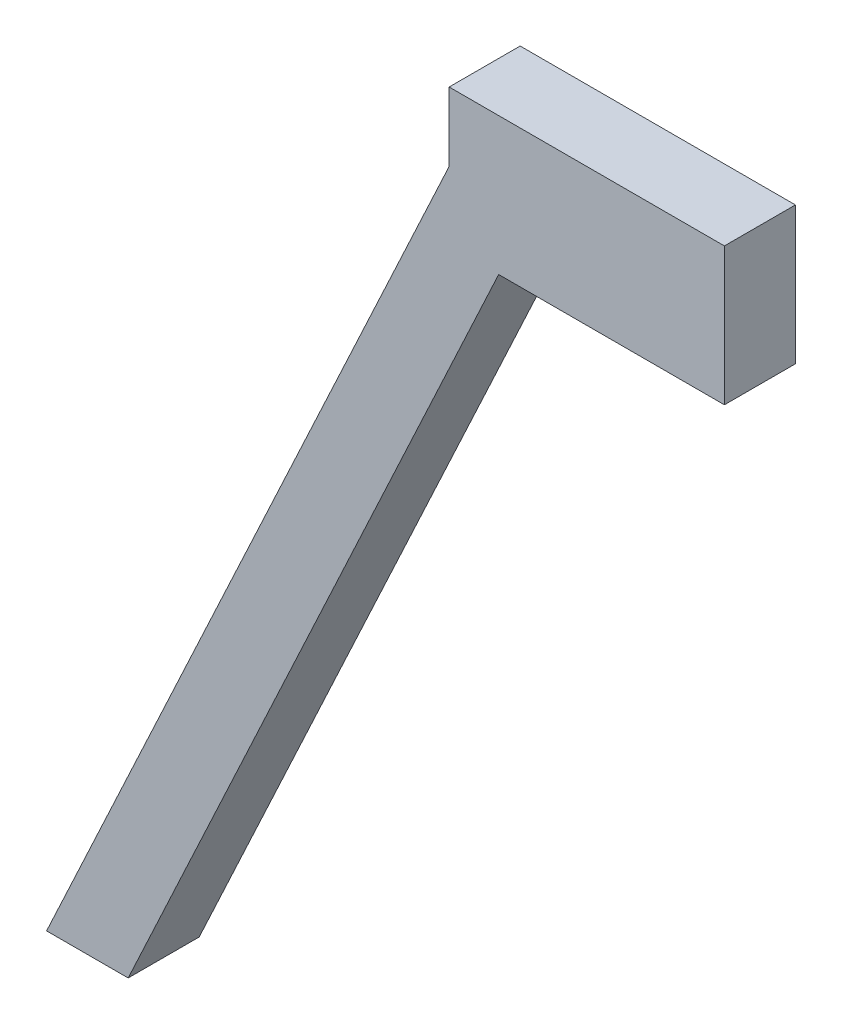
ISO-10303-21;
HEADER;
FILE_DESCRIPTION(('STEP AP214'),'2;1');
FILE_NAME('part.step','',(''),(''),'','','');
FILE_SCHEMA(('AUTOMOTIVE_DESIGN { 1 0 10303 214 1 1 1 1 }'));
ENDSEC;
DATA;
#1=APPLICATION_CONTEXT('core data for automotive mechanical design processes');
#2=APPLICATION_PROTOCOL_DEFINITION('international standard','automotive_design',2000,#1);
#3=PRODUCT_CONTEXT('',#1,'mechanical');
#4=PRODUCT('Part','Part','',(#3));
#5=PRODUCT_RELATED_PRODUCT_CATEGORY('part','',(#4));
#6=PRODUCT_DEFINITION_FORMATION('','',#4);
#7=PRODUCT_DEFINITION_CONTEXT('part definition',#1,'design');
#8=PRODUCT_DEFINITION('design','',#6,#7);
#9=PRODUCT_DEFINITION_SHAPE('','',#8);
#10=(LENGTH_UNIT() NAMED_UNIT(*) SI_UNIT(.MILLI.,.METRE.));
#11=(NAMED_UNIT(*) PLANE_ANGLE_UNIT() SI_UNIT($,.RADIAN.));
#12=(NAMED_UNIT(*) SI_UNIT($,.STERADIAN.) SOLID_ANGLE_UNIT());
#13=UNCERTAINTY_MEASURE_WITH_UNIT(LENGTH_MEASURE(1.E-05),#10,'distance_accuracy_value','');
#14=(GEOMETRIC_REPRESENTATION_CONTEXT(3) GLOBAL_UNCERTAINTY_ASSIGNED_CONTEXT((#13)) GLOBAL_UNIT_ASSIGNED_CONTEXT((#10,
#11,#12)) REPRESENTATION_CONTEXT('',''));
#15=CARTESIAN_POINT('',(0.,0.,0.));
#16=DIRECTION('',(0.,0.,1.));
#17=DIRECTION('',(1.,0.,0.));
#18=AXIS2_PLACEMENT_3D('',#15,#16,#17);
#19=CARTESIAN_POINT('',(7.34521677822614,102.099058209767,-0.318278283350851));
#20=DIRECTION('',(-1.,0.,0.));
#21=DIRECTION('',(0.,-1.,0.));
#22=AXIS2_PLACEMENT_3D('',#19,#20,#21);
#23=PLANE('',#22);
#24=DIRECTION('',(0.,0.,1.));
#25=VECTOR('',#24,1.);
#26=CARTESIAN_POINT('',(7.34521677822615,92.0990582097668,-0.318278283350851));
#27=LINE('',#26,#25);
#28=CARTESIAN_POINT('',(7.34521677822615,92.0990582097668,-0.318278283350851));
#29=VERTEX_POINT('',#28);
#30=CARTESIAN_POINT('',(7.34521677822615,92.0990582097668,10.));
#31=VERTEX_POINT('',#30);
#32=EDGE_CURVE('E97',#29,#31,#27,.T.);
#33=ORIENTED_EDGE('',*,*,#32,.T.);
#34=DIRECTION('',(0.,-1.,0.));
#35=VECTOR('',#34,1.);
#36=CARTESIAN_POINT('',(7.34521677822614,102.099058209767,10.));
#37=LINE('',#36,#35);
#38=CARTESIAN_POINT('',(7.34521677822614,102.099058209767,10.));
#39=VERTEX_POINT('',#38);
#40=EDGE_CURVE('E131',#39,#31,#37,.T.);
#41=ORIENTED_EDGE('',*,*,#40,.F.);
#42=DIRECTION('',(0.,0.,1.));
#43=VECTOR('',#42,1.);
#44=CARTESIAN_POINT('',(7.34521677822614,102.099058209767,-0.318278283350851));
#45=LINE('',#44,#43);
#46=CARTESIAN_POINT('',(7.34521677822614,102.099058209767,-0.318278283350851));
#47=VERTEX_POINT('',#46);
#48=EDGE_CURVE('E40',#47,#39,#45,.T.);
#49=ORIENTED_EDGE('',*,*,#48,.F.);
#50=DIRECTION('',(0.,-1.,0.));
#51=VECTOR('',#50,1.);
#52=CARTESIAN_POINT('',(7.34521677822614,102.099058209767,-0.318278283350851));
#53=LINE('',#52,#51);
#54=EDGE_CURVE('E108',#47,#29,#53,.T.);
#55=ORIENTED_EDGE('',*,*,#54,.T.);
#56=EDGE_LOOP('',(#33,#41,#49,#55));
#57=FACE_BOUND('',#56,.T.);
#58=ADVANCED_FACE('F33',(#57),#23,.T.);
#59=CARTESIAN_POINT('',(7.34521677822614,102.099058209767,-0.318278283350851));
#60=DIRECTION('',(0.,1.,0.));
#61=DIRECTION('',(0.,0.,1.));
#62=AXIS2_PLACEMENT_3D('',#59,#60,#61);
#63=PLANE('',#62);
#64=ORIENTED_EDGE('',*,*,#48,.T.);
#65=DIRECTION('',(-1.,0.,0.));
#66=VECTOR('',#65,1.);
#67=CARTESIAN_POINT('',(7.34521677822614,102.099058209767,10.));
#68=LINE('',#67,#66);
#69=CARTESIAN_POINT('',(47.3452167782261,102.099058209767,10.));
#70=VERTEX_POINT('',#69);
#71=EDGE_CURVE('E112',#70,#39,#68,.T.);
#72=ORIENTED_EDGE('',*,*,#71,.F.);
#73=DIRECTION('',(0.,0.,1.));
#74=VECTOR('',#73,1.);
#75=CARTESIAN_POINT('',(47.3452167782261,102.099058209767,-0.318278283350851));
#76=LINE('',#75,#74);
#77=CARTESIAN_POINT('',(47.3452167782261,102.099058209767,-0.318278283350851));
#78=VERTEX_POINT('',#77);
#79=EDGE_CURVE('E125',#78,#70,#76,.T.);
#80=ORIENTED_EDGE('',*,*,#79,.F.);
#81=DIRECTION('',(-1.,0.,0.));
#82=VECTOR('',#81,1.);
#83=CARTESIAN_POINT('',(7.34521677822614,102.099058209767,-0.318278283350851));
#84=LINE('',#83,#82);
#85=EDGE_CURVE('E121',#78,#47,#84,.T.);
#86=ORIENTED_EDGE('',*,*,#85,.T.);
#87=EDGE_LOOP('',(#64,#72,#80,#86));
#88=FACE_BOUND('',#87,.T.);
#89=ADVANCED_FACE('F156',(#88),#63,.T.);
#90=CARTESIAN_POINT('',(47.3452167782261,102.099058209767,-0.318278283350851));
#91=DIRECTION('',(1.,0.,0.));
#92=DIRECTION('',(0.,1.,0.));
#93=AXIS2_PLACEMENT_3D('',#90,#91,#92);
#94=PLANE('',#93);
#95=ORIENTED_EDGE('',*,*,#79,.T.);
#96=DIRECTION('',(0.,1.,0.));
#97=VECTOR('',#96,1.);
#98=CARTESIAN_POINT('',(47.3452167782261,102.099058209767,10.));
#99=LINE('',#98,#97);
#100=CARTESIAN_POINT('',(47.3452167782261,82.0990582097668,10.));
#101=VERTEX_POINT('',#100);
#102=EDGE_CURVE('E151',#101,#70,#99,.T.);
#103=ORIENTED_EDGE('',*,*,#102,.F.);
#104=DIRECTION('',(0.,0.,1.));
#105=VECTOR('',#104,1.);
#106=CARTESIAN_POINT('',(47.3452167782261,82.0990582097668,-0.318278283350851));
#107=LINE('',#106,#105);
#108=CARTESIAN_POINT('',(47.3452167782261,82.0990582097668,-0.318278283350851));
#109=VERTEX_POINT('',#108);
#110=EDGE_CURVE('E127',#109,#101,#107,.T.);
#111=ORIENTED_EDGE('',*,*,#110,.F.);
#112=DIRECTION('',(0.,1.,0.));
#113=VECTOR('',#112,1.);
#114=CARTESIAN_POINT('',(47.3452167782261,102.099058209767,-0.318278283350851));
#115=LINE('',#114,#113);
#116=EDGE_CURVE('E118',#109,#78,#115,.T.);
#117=ORIENTED_EDGE('',*,*,#116,.T.);
#118=EDGE_LOOP('',(#95,#103,#111,#117));
#119=FACE_BOUND('',#118,.T.);
#120=ADVANCED_FACE('F172',(#119),#94,.T.);
#121=CARTESIAN_POINT('',(14.5398313028482,82.0990582097668,-0.318278283350851));
#122=DIRECTION('',(0.,-1.,0.));
#123=DIRECTION('',(1.,0.,0.));
#124=AXIS2_PLACEMENT_3D('',#121,#122,#123);
#125=PLANE('',#124);
#126=CARTESIAN_POINT('',(37.2232172921372,82.0990582097668,5.));
#127=DIRECTION('',(0.,-1.,0.));
#128=DIRECTION('',(1.,0.,0.));
#129=AXIS2_PLACEMENT_3D('',#126,#127,#128);
#130=CIRCLE('',#129,3.);
#131=CARTESIAN_POINT('',(40.2232172921372,82.0990582097668,5.));
#132=VERTEX_POINT('',#131);
#133=EDGE_CURVE('E143',#132,#132,#130,.T.);
#134=ORIENTED_EDGE('',*,*,#133,.F.);
#135=EDGE_LOOP('',(#134));
#136=FACE_BOUND('',#135,.T.);
#137=ORIENTED_EDGE('',*,*,#110,.T.);
#138=DIRECTION('',(1.,0.,0.));
#139=VECTOR('',#138,1.);
#140=CARTESIAN_POINT('',(14.5398313028482,82.0990582097668,10.));
#141=LINE('',#140,#139);
#142=CARTESIAN_POINT('',(14.5398313028482,82.0990582097668,10.));
#143=VERTEX_POINT('',#142);
#144=EDGE_CURVE('E148',#143,#101,#141,.T.);
#145=ORIENTED_EDGE('',*,*,#144,.F.);
#146=DIRECTION('',(0.,0.,1.));
#147=VECTOR('',#146,1.);
#148=CARTESIAN_POINT('',(14.5398313028482,82.0990582097668,-0.318278283350851));
#149=LINE('',#148,#147);
#150=CARTESIAN_POINT('',(14.5398313028482,82.0990582097668,-0.318278283350851));
#151=VERTEX_POINT('',#150);
#152=EDGE_CURVE('E96',#151,#143,#149,.T.);
#153=ORIENTED_EDGE('',*,*,#152,.F.);
#154=DIRECTION('',(1.,0.,0.));
#155=VECTOR('',#154,1.);
#156=CARTESIAN_POINT('',(14.5398313028482,82.0990582097668,-0.318278283350851));
#157=LINE('',#156,#155);
#158=EDGE_CURVE('E110',#151,#109,#157,.T.);
#159=ORIENTED_EDGE('',*,*,#158,.T.);
#160=EDGE_LOOP('',(#137,#145,#153,#159));
#161=FACE_BOUND('',#160,.T.);
#162=ADVANCED_FACE('F161',(#136,#161),#125,.T.);
#163=CARTESIAN_POINT('',(14.5398313028482,82.0990582097668,-0.318278283350851));
#164=DIRECTION('',(0.906307787036648,-0.422618261740703,0.));
#165=DIRECTION('',(0.422618261740703,0.906307787036648,0.));
#166=AXIS2_PLACEMENT_3D('',#163,#164,#165);
#167=PLANE('',#166);
#168=DIRECTION('',(0.,0.,-1.));
#169=VECTOR('',#168,1.);
#170=CARTESIAN_POINT('',(-39.2990884761205,-33.3588778489894,14.6817217166491));
#171=LINE('',#170,#169);
#172=CARTESIAN_POINT('',(-39.2990884761205,-33.3588778489894,10.));
#173=VERTEX_POINT('',#172);
#174=CARTESIAN_POINT('',(-39.2990884761205,-33.3588778489894,-0.318278283350851));
#175=VERTEX_POINT('',#174);
#176=EDGE_CURVE('E46',#173,#175,#171,.T.);
#177=ORIENTED_EDGE('',*,*,#176,.T.);
#178=DIRECTION('',(0.422618261740703,0.906307787036648,0.));
#179=VECTOR('',#178,1.);
#180=CARTESIAN_POINT('',(14.5398313028482,82.0990582097668,-0.318278283350851));
#181=LINE('',#180,#179);
#182=EDGE_CURVE('E105',#175,#151,#181,.T.);
#183=ORIENTED_EDGE('',*,*,#182,.T.);
#184=ORIENTED_EDGE('',*,*,#152,.T.);
#185=DIRECTION('',(0.422618261740703,0.906307787036648,0.));
#186=VECTOR('',#185,1.);
#187=CARTESIAN_POINT('',(14.5398313028482,82.0990582097668,10.));
#188=LINE('',#187,#186);
#189=EDGE_CURVE('E134',#173,#143,#188,.T.);
#190=ORIENTED_EDGE('',*,*,#189,.F.);
#191=EDGE_LOOP('',(#177,#183,#184,#190));
#192=FACE_BOUND('',#191,.T.);
#193=ADVANCED_FACE('F164',(#192),#167,.T.);
#194=CARTESIAN_POINT('',(-51.1567795822937,-33.3588778489894,-0.318278283350851));
#195=DIRECTION('',(-0.906307787036645,0.42261826174071,0.));
#196=DIRECTION('',(-0.42261826174071,-0.906307787036645,0.));
#197=AXIS2_PLACEMENT_3D('',#194,#195,#196);
#198=PLANE('',#197);
#199=DIRECTION('',(0.,0.,1.));
#200=VECTOR('',#199,1.);
#201=CARTESIAN_POINT('',(-51.1567795822937,-33.3588778489894,-0.318278283350851));
#202=LINE('',#201,#200);
#203=CARTESIAN_POINT('',(-51.1567795822937,-33.3588778489894,-0.318278283350851));
#204=VERTEX_POINT('',#203);
#205=CARTESIAN_POINT('',(-51.1567795822937,-33.3588778489894,10.));
#206=VERTEX_POINT('',#205);
#207=EDGE_CURVE('E88',#204,#206,#202,.T.);
#208=ORIENTED_EDGE('',*,*,#207,.T.);
#209=DIRECTION('',(-0.42261826174071,-0.906307787036645,0.));
#210=VECTOR('',#209,1.);
#211=CARTESIAN_POINT('',(-51.1567795822937,-33.3588778489894,10.));
#212=LINE('',#211,#210);
#213=EDGE_CURVE('E132',#31,#206,#212,.T.);
#214=ORIENTED_EDGE('',*,*,#213,.F.);
#215=ORIENTED_EDGE('',*,*,#32,.F.);
#216=DIRECTION('',(-0.42261826174071,-0.906307787036645,0.));
#217=VECTOR('',#216,1.);
#218=CARTESIAN_POINT('',(-51.1567795822937,-33.3588778489894,-0.318278283350851));
#219=LINE('',#218,#217);
#220=EDGE_CURVE('E103',#29,#204,#219,.T.);
#221=ORIENTED_EDGE('',*,*,#220,.T.);
#222=EDGE_LOOP('',(#208,#214,#215,#221));
#223=FACE_BOUND('',#222,.T.);
#224=ADVANCED_FACE('F107',(#223),#198,.T.);
#225=CARTESIAN_POINT('',(0.,0.,-0.318278283350851));
#226=DIRECTION('',(0.,0.,1.));
#227=DIRECTION('',(1.,0.,0.));
#228=AXIS2_PLACEMENT_3D('',#225,#226,#227);
#229=PLANE('',#228);
#230=ORIENTED_EDGE('',*,*,#182,.F.);
#231=DIRECTION('',(1.,0.,0.));
#232=VECTOR('',#231,1.);
#233=CARTESIAN_POINT('',(-51.1567795822937,-33.3588778489894,-0.318278283350851));
#234=LINE('',#233,#232);
#235=EDGE_CURVE('E91',#204,#175,#234,.T.);
#236=ORIENTED_EDGE('',*,*,#235,.F.);
#237=ORIENTED_EDGE('',*,*,#220,.F.);
#238=ORIENTED_EDGE('',*,*,#54,.F.);
#239=ORIENTED_EDGE('',*,*,#85,.F.);
#240=ORIENTED_EDGE('',*,*,#116,.F.);
#241=ORIENTED_EDGE('',*,*,#158,.F.);
#242=EDGE_LOOP('',(#230,#236,#237,#238,#239,#240,#241));
#243=FACE_BOUND('',#242,.T.);
#244=ADVANCED_FACE('F102',(#243),#229,.F.);
#245=CARTESIAN_POINT('',(0.,0.,10.));
#246=DIRECTION('',(0.,0.,1.));
#247=DIRECTION('',(1.,0.,0.));
#248=AXIS2_PLACEMENT_3D('',#245,#246,#247);
#249=PLANE('',#248);
#250=DIRECTION('',(-1.,0.,0.));
#251=VECTOR('',#250,1.);
#252=CARTESIAN_POINT('',(0.,-33.3588778489894,10.));
#253=LINE('',#252,#251);
#254=EDGE_CURVE('E11',#173,#206,#253,.T.);
#255=ORIENTED_EDGE('',*,*,#254,.F.);
#256=ORIENTED_EDGE('',*,*,#189,.T.);
#257=ORIENTED_EDGE('',*,*,#144,.T.);
#258=ORIENTED_EDGE('',*,*,#102,.T.);
#259=ORIENTED_EDGE('',*,*,#71,.T.);
#260=ORIENTED_EDGE('',*,*,#40,.T.);
#261=ORIENTED_EDGE('',*,*,#213,.T.);
#262=EDGE_LOOP('',(#255,#256,#257,#258,#259,#260,#261));
#263=FACE_BOUND('',#262,.T.);
#264=ADVANCED_FACE('F137',(#263),#249,.T.);
#265=CARTESIAN_POINT('',(37.2232172921372,87.0990582097668,5.));
#266=DIRECTION('',(0.,-1.,0.));
#267=DIRECTION('',(1.,0.,0.));
#268=AXIS2_PLACEMENT_3D('',#265,#266,#267);
#269=CYLINDRICAL_SURFACE('',#268,3.);
#270=CARTESIAN_POINT('',(37.2232172921372,87.0990582097668,5.));
#271=DIRECTION('',(0.,-1.,0.));
#272=DIRECTION('',(1.,0.,0.));
#273=AXIS2_PLACEMENT_3D('',#270,#271,#272);
#274=CIRCLE('',#273,3.);
#275=CARTESIAN_POINT('',(40.2232172921372,87.0990582097668,5.));
#276=VERTEX_POINT('',#275);
#277=EDGE_CURVE('E140',#276,#276,#274,.T.);
#278=ORIENTED_EDGE('',*,*,#277,.F.);
#279=EDGE_LOOP('',(#278));
#280=FACE_BOUND('',#279,.T.);
#281=ORIENTED_EDGE('',*,*,#133,.T.);
#282=EDGE_LOOP('',(#281));
#283=FACE_BOUND('',#282,.T.);
#284=ADVANCED_FACE('F169',(#280,#283),#269,.F.);
#285=CARTESIAN_POINT('',(0.,87.0990582097668,0.));
#286=DIRECTION('',(0.,-1.,0.));
#287=DIRECTION('',(1.,0.,0.));
#288=AXIS2_PLACEMENT_3D('',#285,#286,#287);
#289=PLANE('',#288);
#290=ORIENTED_EDGE('',*,*,#277,.T.);
#291=EDGE_LOOP('',(#290));
#292=FACE_BOUND('',#291,.T.);
#293=ADVANCED_FACE('F194',(#292),#289,.T.);
#294=CARTESIAN_POINT('',(-51.1567795822937,-33.3588778489894,14.6817217166491));
#295=DIRECTION('',(0.,1.,0.));
#296=DIRECTION('',(0.,0.,1.));
#297=AXIS2_PLACEMENT_3D('',#294,#295,#296);
#298=PLANE('',#297);
#299=ORIENTED_EDGE('',*,*,#254,.T.);
#300=ORIENTED_EDGE('',*,*,#207,.F.);
#301=ORIENTED_EDGE('',*,*,#235,.T.);
#302=ORIENTED_EDGE('',*,*,#176,.F.);
#303=EDGE_LOOP('',(#299,#300,#301,#302));
#304=FACE_BOUND('',#303,.T.);
#305=ADVANCED_FACE('F90',(#304),#298,.F.);
#306=CLOSED_SHELL('',(#58,#89,#120,#162,#193,#224,#244,#264,#284,#293,#305));
#307=MANIFOLD_SOLID_BREP('B2',#306);
#308=ADVANCED_BREP_SHAPE_REPRESENTATION('',(#18,#307),#14);
#309=SHAPE_DEFINITION_REPRESENTATION(#9,#308);
ENDSEC;
END-ISO-10303-21;
